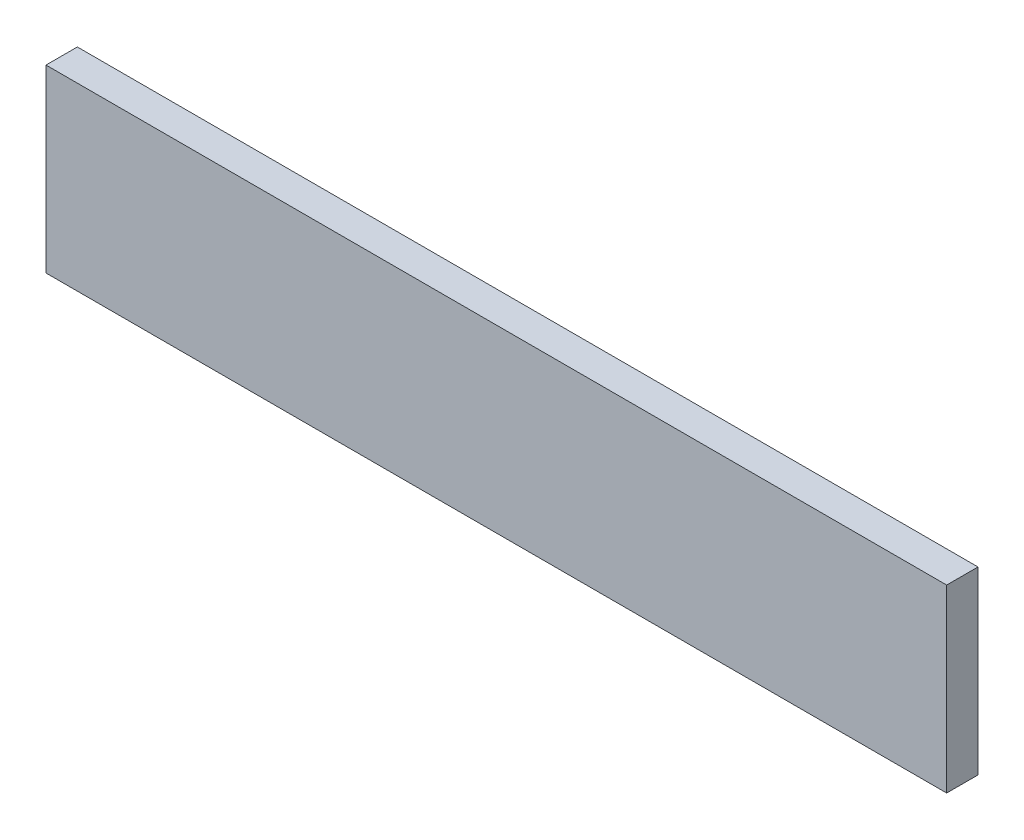
ISO-10303-21;
HEADER;
FILE_DESCRIPTION(('STEP AP214'),'2;1');
FILE_NAME('part.step','',(''),(''),'','','');
FILE_SCHEMA(('AUTOMOTIVE_DESIGN { 1 0 10303 214 1 1 1 1 }'));
ENDSEC;
DATA;
#1=APPLICATION_CONTEXT('core data for automotive mechanical design processes');
#2=APPLICATION_PROTOCOL_DEFINITION('international standard','automotive_design',2000,#1);
#3=PRODUCT_CONTEXT('',#1,'mechanical');
#4=PRODUCT('Part','Part','',(#3));
#5=PRODUCT_RELATED_PRODUCT_CATEGORY('part','',(#4));
#6=PRODUCT_DEFINITION_FORMATION('','',#4);
#7=PRODUCT_DEFINITION_CONTEXT('part definition',#1,'design');
#8=PRODUCT_DEFINITION('design','',#6,#7);
#9=PRODUCT_DEFINITION_SHAPE('','',#8);
#10=(LENGTH_UNIT() NAMED_UNIT(*) SI_UNIT(.MILLI.,.METRE.));
#11=(NAMED_UNIT(*) PLANE_ANGLE_UNIT() SI_UNIT($,.RADIAN.));
#12=(NAMED_UNIT(*) SI_UNIT($,.STERADIAN.) SOLID_ANGLE_UNIT());
#13=UNCERTAINTY_MEASURE_WITH_UNIT(LENGTH_MEASURE(1.E-05),#10,'distance_accuracy_value','');
#14=(GEOMETRIC_REPRESENTATION_CONTEXT(3) GLOBAL_UNCERTAINTY_ASSIGNED_CONTEXT((#13)) GLOBAL_UNIT_ASSIGNED_CONTEXT((#10,
#11,#12)) REPRESENTATION_CONTEXT('',''));
#15=CARTESIAN_POINT('',(0.,0.,0.));
#16=DIRECTION('',(0.,0.,1.));
#17=DIRECTION('',(1.,0.,0.));
#18=AXIS2_PLACEMENT_3D('',#15,#16,#17);
#19=CARTESIAN_POINT('',(0.,0.,-40.));
#20=DIRECTION('',(-1.,0.,0.));
#21=DIRECTION('',(0.,-1.,0.));
#22=AXIS2_PLACEMENT_3D('',#19,#20,#21);
#23=PLANE('',#22);
#24=DIRECTION('',(0.,-1.,0.));
#25=VECTOR('',#24,1.);
#26=CARTESIAN_POINT('',(0.,0.,0.));
#27=LINE('',#26,#25);
#28=CARTESIAN_POINT('',(0.,0.,0.));
#29=VERTEX_POINT('',#28);
#30=CARTESIAN_POINT('',(0.,-230.,0.));
#31=VERTEX_POINT('',#30);
#32=EDGE_CURVE('E100',#29,#31,#27,.T.);
#33=ORIENTED_EDGE('',*,*,#32,.F.);
#34=DIRECTION('',(0.,0.,1.));
#35=VECTOR('',#34,1.);
#36=CARTESIAN_POINT('',(0.,0.,-40.));
#37=LINE('',#36,#35);
#38=CARTESIAN_POINT('',(0.,0.,-40.));
#39=VERTEX_POINT('',#38);
#40=EDGE_CURVE('E11',#39,#29,#37,.T.);
#41=ORIENTED_EDGE('',*,*,#40,.F.);
#42=DIRECTION('',(0.,-1.,0.));
#43=VECTOR('',#42,1.);
#44=CARTESIAN_POINT('',(0.,0.,-40.));
#45=LINE('',#44,#43);
#46=CARTESIAN_POINT('',(0.,-230.,-40.));
#47=VERTEX_POINT('',#46);
#48=EDGE_CURVE('E94',#39,#47,#45,.T.);
#49=ORIENTED_EDGE('',*,*,#48,.T.);
#50=DIRECTION('',(0.,0.,1.));
#51=VECTOR('',#50,1.);
#52=CARTESIAN_POINT('',(0.,-230.,-40.));
#53=LINE('',#52,#51);
#54=EDGE_CURVE('E39',#47,#31,#53,.T.);
#55=ORIENTED_EDGE('',*,*,#54,.T.);
#56=EDGE_LOOP('',(#33,#41,#49,#55));
#57=FACE_BOUND('',#56,.T.);
#58=ADVANCED_FACE('F36',(#57),#23,.T.);
#59=CARTESIAN_POINT('',(0.,0.,-40.));
#60=DIRECTION('',(0.,1.,0.));
#61=DIRECTION('',(0.,0.,1.));
#62=AXIS2_PLACEMENT_3D('',#59,#60,#61);
#63=PLANE('',#62);
#64=DIRECTION('',(-1.,0.,0.));
#65=VECTOR('',#64,1.);
#66=CARTESIAN_POINT('',(0.,0.,0.));
#67=LINE('',#66,#65);
#68=CARTESIAN_POINT('',(1150.,0.,0.));
#69=VERTEX_POINT('',#68);
#70=EDGE_CURVE('E96',#69,#29,#67,.T.);
#71=ORIENTED_EDGE('',*,*,#70,.F.);
#72=DIRECTION('',(0.,0.,1.));
#73=VECTOR('',#72,1.);
#74=CARTESIAN_POINT('',(1150.,0.,-40.));
#75=LINE('',#74,#73);
#76=CARTESIAN_POINT('',(1150.,0.,-40.));
#77=VERTEX_POINT('',#76);
#78=EDGE_CURVE('E45',#77,#69,#75,.T.);
#79=ORIENTED_EDGE('',*,*,#78,.F.);
#80=DIRECTION('',(-1.,0.,0.));
#81=VECTOR('',#80,1.);
#82=CARTESIAN_POINT('',(0.,0.,-40.));
#83=LINE('',#82,#81);
#84=EDGE_CURVE('E91',#77,#39,#83,.T.);
#85=ORIENTED_EDGE('',*,*,#84,.T.);
#86=ORIENTED_EDGE('',*,*,#40,.T.);
#87=EDGE_LOOP('',(#71,#79,#85,#86));
#88=FACE_BOUND('',#87,.T.);
#89=ADVANCED_FACE('F110',(#88),#63,.T.);
#90=CARTESIAN_POINT('',(1150.,0.,-40.));
#91=DIRECTION('',(1.,0.,0.));
#92=DIRECTION('',(0.,0.,-1.));
#93=AXIS2_PLACEMENT_3D('',#90,#91,#92);
#94=PLANE('',#93);
#95=DIRECTION('',(0.,1.,0.));
#96=VECTOR('',#95,1.);
#97=CARTESIAN_POINT('',(1150.,0.,0.));
#98=LINE('',#97,#96);
#99=CARTESIAN_POINT('',(1150.,-230.,0.));
#100=VERTEX_POINT('',#99);
#101=EDGE_CURVE('E86',#100,#69,#98,.T.);
#102=ORIENTED_EDGE('',*,*,#101,.F.);
#103=DIRECTION('',(0.,0.,1.));
#104=VECTOR('',#103,1.);
#105=CARTESIAN_POINT('',(1150.,-230.,-40.));
#106=LINE('',#105,#104);
#107=CARTESIAN_POINT('',(1150.,-230.,-40.));
#108=VERTEX_POINT('',#107);
#109=EDGE_CURVE('E81',#108,#100,#106,.T.);
#110=ORIENTED_EDGE('',*,*,#109,.F.);
#111=DIRECTION('',(0.,1.,0.));
#112=VECTOR('',#111,1.);
#113=CARTESIAN_POINT('',(1150.,0.,-40.));
#114=LINE('',#113,#112);
#115=EDGE_CURVE('E84',#108,#77,#114,.T.);
#116=ORIENTED_EDGE('',*,*,#115,.T.);
#117=ORIENTED_EDGE('',*,*,#78,.T.);
#118=EDGE_LOOP('',(#102,#110,#116,#117));
#119=FACE_BOUND('',#118,.T.);
#120=ADVANCED_FACE('F83',(#119),#94,.T.);
#121=CARTESIAN_POINT('',(0.,-230.,-40.));
#122=DIRECTION('',(0.,-1.,0.));
#123=DIRECTION('',(0.,0.,-1.));
#124=AXIS2_PLACEMENT_3D('',#121,#122,#123);
#125=PLANE('',#124);
#126=DIRECTION('',(1.,0.,0.));
#127=VECTOR('',#126,1.);
#128=CARTESIAN_POINT('',(0.,-230.,0.));
#129=LINE('',#128,#127);
#130=EDGE_CURVE('E103',#31,#100,#129,.T.);
#131=ORIENTED_EDGE('',*,*,#130,.F.);
#132=ORIENTED_EDGE('',*,*,#54,.F.);
#133=DIRECTION('',(1.,0.,0.));
#134=VECTOR('',#133,1.);
#135=CARTESIAN_POINT('',(0.,-230.,-40.));
#136=LINE('',#135,#134);
#137=EDGE_CURVE('E90',#47,#108,#136,.T.);
#138=ORIENTED_EDGE('',*,*,#137,.T.);
#139=ORIENTED_EDGE('',*,*,#109,.T.);
#140=EDGE_LOOP('',(#131,#132,#138,#139));
#141=FACE_BOUND('',#140,.T.);
#142=ADVANCED_FACE('F93',(#141),#125,.T.);
#143=CARTESIAN_POINT('',(0.,0.,-40.));
#144=DIRECTION('',(0.,0.,1.));
#145=DIRECTION('',(1.,0.,0.));
#146=AXIS2_PLACEMENT_3D('',#143,#144,#145);
#147=PLANE('',#146);
#148=ORIENTED_EDGE('',*,*,#48,.F.);
#149=ORIENTED_EDGE('',*,*,#84,.F.);
#150=ORIENTED_EDGE('',*,*,#115,.F.);
#151=ORIENTED_EDGE('',*,*,#137,.F.);
#152=EDGE_LOOP('',(#148,#149,#150,#151));
#153=FACE_BOUND('',#152,.T.);
#154=ADVANCED_FACE('F89',(#153),#147,.F.);
#155=CARTESIAN_POINT('',(0.,0.,0.));
#156=DIRECTION('',(0.,0.,1.));
#157=DIRECTION('',(1.,0.,0.));
#158=AXIS2_PLACEMENT_3D('',#155,#156,#157);
#159=PLANE('',#158);
#160=ORIENTED_EDGE('',*,*,#32,.T.);
#161=ORIENTED_EDGE('',*,*,#130,.T.);
#162=ORIENTED_EDGE('',*,*,#101,.T.);
#163=ORIENTED_EDGE('',*,*,#70,.T.);
#164=EDGE_LOOP('',(#160,#161,#162,#163));
#165=FACE_BOUND('',#164,.T.);
#166=ADVANCED_FACE('F109',(#165),#159,.T.);
#167=CLOSED_SHELL('',(#58,#89,#120,#142,#154,#166));
#168=MANIFOLD_SOLID_BREP('B2',#167);
#169=ADVANCED_BREP_SHAPE_REPRESENTATION('',(#18,#168),#14);
#170=SHAPE_DEFINITION_REPRESENTATION(#9,#169);
ENDSEC;
END-ISO-10303-21;
